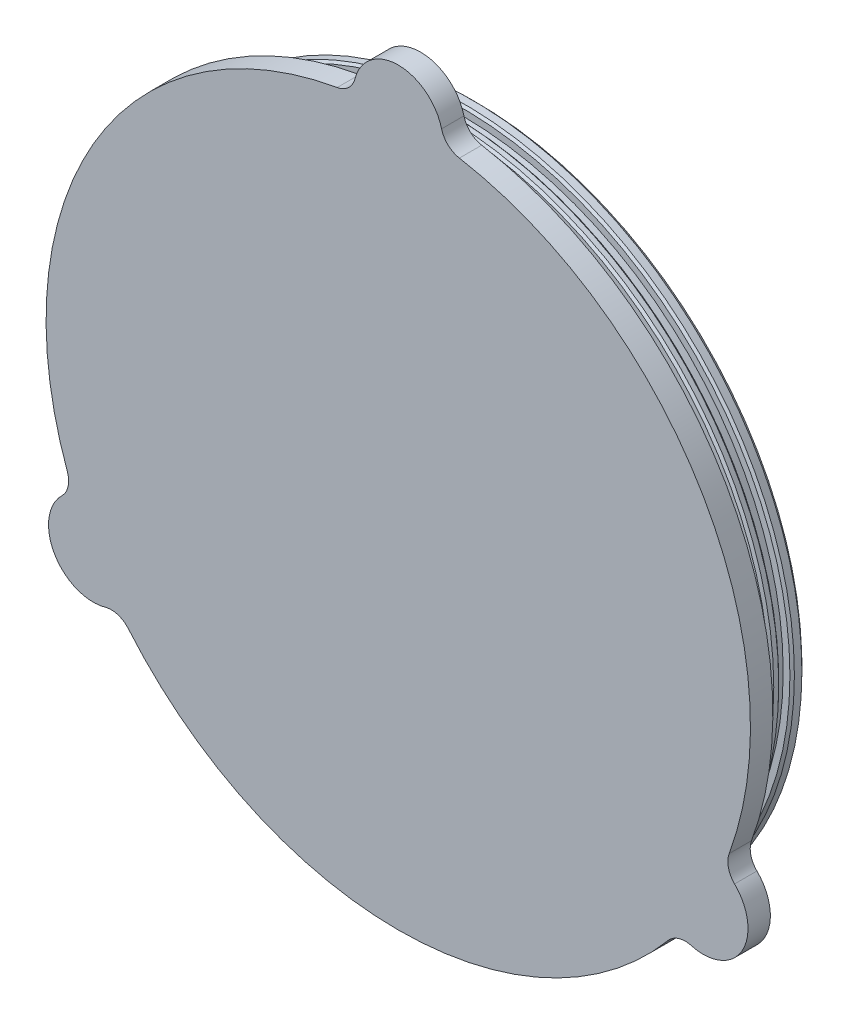
ISO-10303-21;
HEADER;
FILE_DESCRIPTION(('STEP AP214'),'2;1');
FILE_NAME('part.step','',(''),(''),'','','');
FILE_SCHEMA(('AUTOMOTIVE_DESIGN { 1 0 10303 214 1 1 1 1 }'));
ENDSEC;
DATA;
#1=APPLICATION_CONTEXT('core data for automotive mechanical design processes');
#2=APPLICATION_PROTOCOL_DEFINITION('international standard','automotive_design',2000,#1);
#3=PRODUCT_CONTEXT('',#1,'mechanical');
#4=PRODUCT('Part','Part','',(#3));
#5=PRODUCT_RELATED_PRODUCT_CATEGORY('part','',(#4));
#6=PRODUCT_DEFINITION_FORMATION('','',#4);
#7=PRODUCT_DEFINITION_CONTEXT('part definition',#1,'design');
#8=PRODUCT_DEFINITION('design','',#6,#7);
#9=PRODUCT_DEFINITION_SHAPE('','',#8);
#10=(LENGTH_UNIT() NAMED_UNIT(*) SI_UNIT(.MILLI.,.METRE.));
#11=(NAMED_UNIT(*) PLANE_ANGLE_UNIT() SI_UNIT($,.RADIAN.));
#12=(NAMED_UNIT(*) SI_UNIT($,.STERADIAN.) SOLID_ANGLE_UNIT());
#13=UNCERTAINTY_MEASURE_WITH_UNIT(LENGTH_MEASURE(1.E-05),#10,'distance_accuracy_value','');
#14=(GEOMETRIC_REPRESENTATION_CONTEXT(3) GLOBAL_UNCERTAINTY_ASSIGNED_CONTEXT((#13)) GLOBAL_UNIT_ASSIGNED_CONTEXT((#10,
#11,#12)) REPRESENTATION_CONTEXT('',''));
#15=CARTESIAN_POINT('',(0.,0.,0.));
#16=DIRECTION('',(0.,0.,1.));
#17=DIRECTION('',(1.,0.,0.));
#18=AXIS2_PLACEMENT_3D('',#15,#16,#17);
#19=CARTESIAN_POINT('',(0.,0.,6.35));
#20=DIRECTION('',(0.,0.,-1.));
#21=DIRECTION('',(-1.,0.,0.));
#22=AXIS2_PLACEMENT_3D('',#19,#20,#21);
#23=CYLINDRICAL_SURFACE('',#22,100.0125);
#24=CARTESIAN_POINT('',(0.,0.,6.35));
#25=DIRECTION('',(0.,0.,1.));
#26=DIRECTION('',(1.,0.,0.));
#27=AXIS2_PLACEMENT_3D('',#24,#25,#26);
#28=CIRCLE('',#27,100.0125);
#29=CARTESIAN_POINT('',(-17.3499847048401,98.4960820895522,6.35));
#30=VERTEX_POINT('',#29);
#31=CARTESIAN_POINT('',(-93.9751016152096,-34.2225135351136,6.35));
#32=VERTEX_POINT('',#31);
#33=EDGE_CURVE('E136',#30,#32,#28,.T.);
#34=ORIENTED_EDGE('',*,*,#33,.F.);
#35=DIRECTION('',(0.,0.,-1.));
#36=VECTOR('',#35,1.);
#37=CARTESIAN_POINT('',(-17.3499847048401,98.4960820895522,6.35));
#38=LINE('',#37,#36);
#39=CARTESIAN_POINT('',(-17.3499847048401,98.4960820895522,0.));
#40=VERTEX_POINT('',#39);
#41=EDGE_CURVE('E166',#30,#40,#38,.T.);
#42=ORIENTED_EDGE('',*,*,#41,.T.);
#43=CARTESIAN_POINT('',(0.,0.,0.));
#44=DIRECTION('',(0.,0.,1.));
#45=DIRECTION('',(1.,0.,0.));
#46=AXIS2_PLACEMENT_3D('',#43,#44,#45);
#47=CIRCLE('',#46,100.0125);
#48=CARTESIAN_POINT('',(-93.9751016152096,-34.2225135351136,0.));
#49=VERTEX_POINT('',#48);
#50=EDGE_CURVE('E196',#40,#49,#47,.T.);
#51=ORIENTED_EDGE('',*,*,#50,.T.);
#52=DIRECTION('',(0.,0.,-1.));
#53=VECTOR('',#52,1.);
#54=CARTESIAN_POINT('',(-93.9751016152096,-34.2225135351136,6.35));
#55=LINE('',#54,#53);
#56=EDGE_CURVE('E163',#49,#32,#55,.F.);
#57=ORIENTED_EDGE('',*,*,#56,.T.);
#58=EDGE_LOOP('',(#34,#42,#51,#57));
#59=FACE_BOUND('',#58,.T.);
#60=ADVANCED_FACE('F35',(#59),#23,.T.);
#61=CARTESIAN_POINT('',(-76.6251169103693,-64.2735685544395,0.));
#62=VERTEX_POINT('',#61);
#63=CARTESIAN_POINT('',(76.6251169103693,-64.2735685544394,0.));
#64=VERTEX_POINT('',#63);
#65=EDGE_CURVE('E206',#62,#64,#47,.T.);
#66=ORIENTED_EDGE('',*,*,#65,.T.);
#67=DIRECTION('',(0.,0.,-1.));
#68=VECTOR('',#67,1.);
#69=CARTESIAN_POINT('',(76.6251169103693,-64.2735685544394,6.35));
#70=LINE('',#69,#68);
#71=CARTESIAN_POINT('',(76.6251169103693,-64.2735685544394,6.35));
#72=VERTEX_POINT('',#71);
#73=EDGE_CURVE('E135',#64,#72,#70,.F.);
#74=ORIENTED_EDGE('',*,*,#73,.T.);
#75=CARTESIAN_POINT('',(-76.6251169103693,-64.2735685544395,6.35));
#76=VERTEX_POINT('',#75);
#77=EDGE_CURVE('E125',#76,#72,#28,.T.);
#78=ORIENTED_EDGE('',*,*,#77,.F.);
#79=DIRECTION('',(0.,0.,-1.));
#80=VECTOR('',#79,1.);
#81=CARTESIAN_POINT('',(-76.6251169103693,-64.2735685544395,6.35));
#82=LINE('',#81,#80);
#83=EDGE_CURVE('E132',#76,#62,#82,.T.);
#84=ORIENTED_EDGE('',*,*,#83,.T.);
#85=EDGE_LOOP('',(#66,#74,#78,#84));
#86=FACE_BOUND('',#85,.T.);
#87=ADVANCED_FACE('F131',(#86),#23,.T.);
#88=CARTESIAN_POINT('',(0.,0.,-15.875));
#89=DIRECTION('',(0.,0.,1.));
#90=DIRECTION('',(1.,0.,0.));
#91=AXIS2_PLACEMENT_3D('',#88,#89,#90);
#92=CYLINDRICAL_SURFACE('',#91,93.6625);
#93=CARTESIAN_POINT('',(0.,0.,-6.61841179374618));
#94=DIRECTION('',(0.,0.,1.));
#95=DIRECTION('',(1.,0.,0.));
#96=AXIS2_PLACEMENT_3D('',#93,#94,#95);
#97=CIRCLE('',#96,93.6625);
#98=CARTESIAN_POINT('',(93.6625,0.,-6.61841179374618));
#99=VERTEX_POINT('',#98);
#100=EDGE_CURVE('E265',#99,#99,#97,.F.);
#101=ORIENTED_EDGE('',*,*,#100,.T.);
#102=EDGE_LOOP('',(#101));
#103=FACE_BOUND('',#102,.T.);
#104=CARTESIAN_POINT('',(0.,0.,-8.0294907406934));
#105=DIRECTION('',(0.,0.,-1.));
#106=DIRECTION('',(-1.,0.,0.));
#107=AXIS2_PLACEMENT_3D('',#104,#105,#106);
#108=CIRCLE('',#107,93.6625);
#109=CARTESIAN_POINT('',(-93.6625,0.,-8.0294907406934));
#110=VERTEX_POINT('',#109);
#111=EDGE_CURVE('E262',#110,#110,#108,.F.);
#112=ORIENTED_EDGE('',*,*,#111,.T.);
#113=EDGE_LOOP('',(#112));
#114=FACE_BOUND('',#113,.T.);
#115=ADVANCED_FACE('F299',(#103,#114),#92,.T.);
#116=CARTESIAN_POINT('',(0.,0.,-2.17341179374612));
#117=DIRECTION('',(0.,0.,-1.));
#118=DIRECTION('',(-1.,0.,0.));
#119=AXIS2_PLACEMENT_3D('',#116,#117,#118);
#120=CIRCLE('',#119,93.6625);
#121=CARTESIAN_POINT('',(-93.6625,0.,-2.17341179374612));
#122=VERTEX_POINT('',#121);
#123=EDGE_CURVE('E253',#122,#122,#120,.F.);
#124=ORIENTED_EDGE('',*,*,#123,.T.);
#125=EDGE_LOOP('',(#124));
#126=FACE_BOUND('',#125,.T.);
#127=CARTESIAN_POINT('',(0.,0.,0.));
#128=DIRECTION('',(0.,0.,1.));
#129=DIRECTION('',(1.,0.,0.));
#130=AXIS2_PLACEMENT_3D('',#127,#128,#129);
#131=CIRCLE('',#130,93.6625);
#132=CARTESIAN_POINT('',(93.6625,0.,0.));
#133=VERTEX_POINT('',#132);
#134=EDGE_CURVE('E243',#133,#133,#131,.F.);
#135=ORIENTED_EDGE('',*,*,#134,.T.);
#136=EDGE_LOOP('',(#135));
#137=FACE_BOUND('',#136,.T.);
#138=ADVANCED_FACE('F310',(#126,#137),#92,.T.);
#139=CARTESIAN_POINT('',(0.,0.,0.));
#140=DIRECTION('',(0.,0.,1.));
#141=DIRECTION('',(1.,0.,0.));
#142=AXIS2_PLACEMENT_3D('',#139,#140,#141);
#143=PLANE('',#142);
#144=ORIENTED_EDGE('',*,*,#50,.F.);
#145=CARTESIAN_POINT('',(-18.4515710353062,104.749801587302,0.));
#146=DIRECTION('',(0.,0.,1.));
#147=DIRECTION('',(1.,0.,0.));
#148=AXIS2_PLACEMENT_3D('',#145,#146,#147);
#149=CIRCLE('',#148,6.35);
#150=CARTESIAN_POINT('',(-12.3010473568708,103.170701058201,0.));
#151=VERTEX_POINT('',#150);
#152=EDGE_CURVE('E186',#40,#151,#149,.T.);
#153=ORIENTED_EDGE('',*,*,#152,.T.);
#154=CARTESIAN_POINT('',(0.,100.0125,0.));
#155=DIRECTION('',(0.,0.,1.));
#156=DIRECTION('',(1.,0.,0.));
#157=AXIS2_PLACEMENT_3D('',#154,#155,#156);
#158=CIRCLE('',#157,12.7);
#159=CARTESIAN_POINT('',(12.3010473568708,103.170701058201,0.));
#160=VERTEX_POINT('',#159);
#161=EDGE_CURVE('E223',#151,#160,#158,.F.);
#162=ORIENTED_EDGE('',*,*,#161,.T.);
#163=CARTESIAN_POINT('',(18.4515710353061,104.749801587302,0.));
#164=DIRECTION('',(0.,0.,1.));
#165=DIRECTION('',(1.,0.,0.));
#166=AXIS2_PLACEMENT_3D('',#163,#164,#165);
#167=CIRCLE('',#166,6.35);
#168=CARTESIAN_POINT('',(17.3499847048401,98.4960820895522,0.));
#169=VERTEX_POINT('',#168);
#170=EDGE_CURVE('E182',#160,#169,#167,.T.);
#171=ORIENTED_EDGE('',*,*,#170,.T.);
#172=CARTESIAN_POINT('',(93.9751016152096,-34.2225135351135,0.));
#173=VERTEX_POINT('',#172);
#174=EDGE_CURVE('E208',#173,#169,#47,.T.);
#175=ORIENTED_EDGE('',*,*,#174,.F.);
#176=CARTESIAN_POINT('',(99.9417747336356,-36.3953715373429,0.));
#177=DIRECTION('',(0.,0.,1.));
#178=DIRECTION('',(1.,0.,0.));
#179=AXIS2_PLACEMENT_3D('',#176,#177,#178);
#180=CIRCLE('',#179,6.35);
#181=CARTESIAN_POINT('',(95.4989717210874,-40.9323310248954,0.));
#182=VERTEX_POINT('',#181);
#183=EDGE_CURVE('E178',#173,#182,#180,.T.);
#184=ORIENTED_EDGE('',*,*,#183,.T.);
#185=CARTESIAN_POINT('',(86.6133656959909,-50.0062500000004,0.));
#186=DIRECTION('',(0.,0.,1.));
#187=DIRECTION('',(1.,0.,0.));
#188=AXIS2_PLACEMENT_3D('',#185,#186,#187);
#189=CIRCLE('',#188,12.7);
#190=CARTESIAN_POINT('',(83.1979243642165,-62.2383700333064,0.));
#191=VERTEX_POINT('',#190);
#192=EDGE_CURVE('E218',#182,#191,#189,.F.);
#193=ORIENTED_EDGE('',*,*,#192,.T.);
#194=CARTESIAN_POINT('',(81.4902036983293,-68.3544300499594,0.));
#195=DIRECTION('',(0.,0.,1.));
#196=DIRECTION('',(1.,0.,0.));
#197=AXIS2_PLACEMENT_3D('',#194,#195,#196);
#198=CIRCLE('',#197,6.35);
#199=EDGE_CURVE('E174',#191,#64,#198,.T.);
#200=ORIENTED_EDGE('',*,*,#199,.T.);
#201=ORIENTED_EDGE('',*,*,#65,.F.);
#202=CARTESIAN_POINT('',(-81.4902036983292,-68.3544300499595,0.));
#203=DIRECTION('',(0.,0.,1.));
#204=DIRECTION('',(1.,0.,0.));
#205=AXIS2_PLACEMENT_3D('',#202,#203,#204);
#206=CIRCLE('',#205,6.35);
#207=CARTESIAN_POINT('',(-83.1979243642165,-62.2383700333065,0.));
#208=VERTEX_POINT('',#207);
#209=EDGE_CURVE('E11',#62,#208,#206,.T.);
#210=ORIENTED_EDGE('',*,*,#209,.T.);
#211=CARTESIAN_POINT('',(-86.6133656959909,-50.0062500000004,0.));
#212=DIRECTION('',(0.,0.,1.));
#213=DIRECTION('',(1.,0.,0.));
#214=AXIS2_PLACEMENT_3D('',#211,#212,#213);
#215=CIRCLE('',#214,12.7);
#216=CARTESIAN_POINT('',(-95.4989717210874,-40.9323310248955,0.));
#217=VERTEX_POINT('',#216);
#218=EDGE_CURVE('E199',#208,#217,#215,.F.);
#219=ORIENTED_EDGE('',*,*,#218,.T.);
#220=CARTESIAN_POINT('',(-99.9417747336356,-36.395371537343,0.));
#221=DIRECTION('',(0.,0.,1.));
#222=DIRECTION('',(1.,0.,0.));
#223=AXIS2_PLACEMENT_3D('',#220,#221,#222);
#224=CIRCLE('',#223,6.35);
#225=EDGE_CURVE('E127',#217,#49,#224,.T.);
#226=ORIENTED_EDGE('',*,*,#225,.T.);
#227=EDGE_LOOP('',(#144,#153,#162,#171,#175,#184,#193,#200,#201,#210,#219,#226));
#228=FACE_BOUND('',#227,.T.);
#229=ORIENTED_EDGE('',*,*,#134,.F.);
#230=EDGE_LOOP('',(#229));
#231=FACE_BOUND('',#230,.T.);
#232=ADVANCED_FACE('F194',(#228,#231),#143,.F.);
#233=CARTESIAN_POINT('',(93.9751016152096,-34.2225135351135,6.35));
#234=VERTEX_POINT('',#233);
#235=CARTESIAN_POINT('',(17.3499847048401,98.4960820895522,6.35));
#236=VERTEX_POINT('',#235);
#237=EDGE_CURVE('E137',#234,#236,#28,.T.);
#238=ORIENTED_EDGE('',*,*,#237,.F.);
#239=DIRECTION('',(0.,0.,-1.));
#240=VECTOR('',#239,1.);
#241=CARTESIAN_POINT('',(93.9751016152096,-34.2225135351135,6.35));
#242=LINE('',#241,#240);
#243=EDGE_CURVE('E156',#234,#173,#242,.T.);
#244=ORIENTED_EDGE('',*,*,#243,.T.);
#245=ORIENTED_EDGE('',*,*,#174,.T.);
#246=DIRECTION('',(0.,0.,-1.));
#247=VECTOR('',#246,1.);
#248=CARTESIAN_POINT('',(17.3499847048401,98.4960820895522,6.35));
#249=LINE('',#248,#247);
#250=EDGE_CURVE('E153',#169,#236,#249,.F.);
#251=ORIENTED_EDGE('',*,*,#250,.T.);
#252=EDGE_LOOP('',(#238,#244,#245,#251));
#253=FACE_BOUND('',#252,.T.);
#254=ADVANCED_FACE('F295',(#253),#23,.T.);
#255=CARTESIAN_POINT('',(0.,0.,6.35));
#256=DIRECTION('',(0.,0.,1.));
#257=DIRECTION('',(1.,0.,0.));
#258=AXIS2_PLACEMENT_3D('',#255,#256,#257);
#259=PLANE('',#258);
#260=CARTESIAN_POINT('',(0.,100.0125,6.35));
#261=DIRECTION('',(0.,0.,1.));
#262=DIRECTION('',(-1.,0.,0.));
#263=AXIS2_PLACEMENT_3D('',#260,#261,#262);
#264=CIRCLE('',#263,12.7);
#265=CARTESIAN_POINT('',(12.3010473568708,103.170701058201,6.35));
#266=VERTEX_POINT('',#265);
#267=CARTESIAN_POINT('',(-12.3010473568708,103.170701058201,6.35));
#268=VERTEX_POINT('',#267);
#269=EDGE_CURVE('E221',#266,#268,#264,.T.);
#270=ORIENTED_EDGE('',*,*,#269,.T.);
#271=CARTESIAN_POINT('',(-18.4515710353062,104.749801587302,6.35));
#272=DIRECTION('',(0.,0.,1.));
#273=DIRECTION('',(1.,0.,0.));
#274=AXIS2_PLACEMENT_3D('',#271,#272,#273);
#275=CIRCLE('',#274,6.35);
#276=EDGE_CURVE('E184',#268,#30,#275,.F.);
#277=ORIENTED_EDGE('',*,*,#276,.T.);
#278=ORIENTED_EDGE('',*,*,#33,.T.);
#279=CARTESIAN_POINT('',(-99.9417747336356,-36.395371537343,6.35));
#280=DIRECTION('',(0.,0.,1.));
#281=DIRECTION('',(1.,0.,0.));
#282=AXIS2_PLACEMENT_3D('',#279,#280,#281);
#283=CIRCLE('',#282,6.35);
#284=CARTESIAN_POINT('',(-95.4989717210874,-40.9323310248955,6.35));
#285=VERTEX_POINT('',#284);
#286=EDGE_CURVE('E57',#32,#285,#283,.F.);
#287=ORIENTED_EDGE('',*,*,#286,.T.);
#288=CARTESIAN_POINT('',(-86.6133656959909,-50.0062500000004,6.35));
#289=DIRECTION('',(0.,0.,1.));
#290=DIRECTION('',(1.,0.,0.));
#291=AXIS2_PLACEMENT_3D('',#288,#289,#290);
#292=CIRCLE('',#291,12.7);
#293=CARTESIAN_POINT('',(-83.1979243642165,-62.2383700333065,6.35));
#294=VERTEX_POINT('',#293);
#295=EDGE_CURVE('E126',#285,#294,#292,.T.);
#296=ORIENTED_EDGE('',*,*,#295,.T.);
#297=CARTESIAN_POINT('',(-81.4902036983292,-68.3544300499595,6.35));
#298=DIRECTION('',(0.,0.,1.));
#299=DIRECTION('',(1.,0.,0.));
#300=AXIS2_PLACEMENT_3D('',#297,#298,#299);
#301=CIRCLE('',#300,6.35);
#302=EDGE_CURVE('E43',#294,#76,#301,.F.);
#303=ORIENTED_EDGE('',*,*,#302,.T.);
#304=ORIENTED_EDGE('',*,*,#77,.T.);
#305=CARTESIAN_POINT('',(81.4902036983293,-68.3544300499594,6.35));
#306=DIRECTION('',(0.,0.,1.));
#307=DIRECTION('',(1.,0.,0.));
#308=AXIS2_PLACEMENT_3D('',#305,#306,#307);
#309=CIRCLE('',#308,6.35);
#310=CARTESIAN_POINT('',(83.1979243642165,-62.2383700333064,6.35));
#311=VERTEX_POINT('',#310);
#312=EDGE_CURVE('E172',#72,#311,#309,.F.);
#313=ORIENTED_EDGE('',*,*,#312,.T.);
#314=CARTESIAN_POINT('',(86.6133656959909,-50.0062500000004,6.35));
#315=DIRECTION('',(0.,0.,1.));
#316=DIRECTION('',(-1.,0.,0.));
#317=AXIS2_PLACEMENT_3D('',#314,#315,#316);
#318=CIRCLE('',#317,12.7);
#319=CARTESIAN_POINT('',(95.4989717210874,-40.9323310248954,6.35));
#320=VERTEX_POINT('',#319);
#321=EDGE_CURVE('E213',#311,#320,#318,.T.);
#322=ORIENTED_EDGE('',*,*,#321,.T.);
#323=CARTESIAN_POINT('',(99.9417747336356,-36.3953715373429,6.35));
#324=DIRECTION('',(0.,0.,1.));
#325=DIRECTION('',(1.,0.,0.));
#326=AXIS2_PLACEMENT_3D('',#323,#324,#325);
#327=CIRCLE('',#326,6.35);
#328=EDGE_CURVE('E176',#320,#234,#327,.F.);
#329=ORIENTED_EDGE('',*,*,#328,.T.);
#330=ORIENTED_EDGE('',*,*,#237,.T.);
#331=CARTESIAN_POINT('',(18.4515710353061,104.749801587302,6.35));
#332=DIRECTION('',(0.,0.,1.));
#333=DIRECTION('',(1.,0.,0.));
#334=AXIS2_PLACEMENT_3D('',#331,#332,#333);
#335=CIRCLE('',#334,6.35);
#336=EDGE_CURVE('E180',#236,#266,#335,.F.);
#337=ORIENTED_EDGE('',*,*,#336,.T.);
#338=EDGE_LOOP('',(#270,#277,#278,#287,#296,#303,#304,#313,#322,#329,#330,#337));
#339=FACE_BOUND('',#338,.T.);
#340=ADVANCED_FACE('F124',(#339),#259,.T.);
#341=CARTESIAN_POINT('',(0.,93.6625,-2.80841179374613));
#342=DIRECTION('',(0.,0.,-1.));
#343=DIRECTION('',(-1.,0.,0.));
#344=AXIS2_PLACEMENT_3D('',#341,#342,#343);
#345=PLANE('',#344);
#346=CARTESIAN_POINT('',(0.,0.,-2.80841179374613));
#347=DIRECTION('',(0.,0.,-1.));
#348=DIRECTION('',(-1.,0.,0.));
#349=AXIS2_PLACEMENT_3D('',#346,#347,#348);
#350=CIRCLE('',#349,93.0275);
#351=CARTESIAN_POINT('',(-93.0275,0.,-2.80841179374613));
#352=VERTEX_POINT('',#351);
#353=EDGE_CURVE('E256',#352,#352,#350,.T.);
#354=ORIENTED_EDGE('',*,*,#353,.T.);
#355=EDGE_LOOP('',(#354));
#356=FACE_BOUND('',#355,.T.);
#357=CARTESIAN_POINT('',(0.,0.,-2.80841179374613));
#358=DIRECTION('',(0.,0.,1.));
#359=DIRECTION('',(1.,0.,0.));
#360=AXIS2_PLACEMENT_3D('',#357,#358,#359);
#361=CIRCLE('',#360,91.1225);
#362=CARTESIAN_POINT('',(91.1225,0.,-2.80841179374613));
#363=VERTEX_POINT('',#362);
#364=EDGE_CURVE('E235',#363,#363,#361,.T.);
#365=ORIENTED_EDGE('',*,*,#364,.T.);
#366=EDGE_LOOP('',(#365));
#367=FACE_BOUND('',#366,.T.);
#368=ADVANCED_FACE('F308',(#356,#367),#345,.T.);
#369=CARTESIAN_POINT('',(0.,0.,0.));
#370=DIRECTION('',(0.,0.,1.));
#371=DIRECTION('',(1.,0.,0.));
#372=AXIS2_PLACEMENT_3D('',#369,#370,#371);
#373=CYLINDRICAL_SURFACE('',#372,91.1225);
#374=CARTESIAN_POINT('',(0.,0.,-5.98341179374613));
#375=DIRECTION('',(0.,0.,1.));
#376=DIRECTION('',(1.,0.,0.));
#377=AXIS2_PLACEMENT_3D('',#374,#375,#376);
#378=CIRCLE('',#377,91.1225);
#379=CARTESIAN_POINT('',(91.1225,0.,-5.98341179374613));
#380=VERTEX_POINT('',#379);
#381=EDGE_CURVE('E232',#380,#380,#378,.T.);
#382=ORIENTED_EDGE('',*,*,#381,.T.);
#383=EDGE_LOOP('',(#382));
#384=FACE_BOUND('',#383,.T.);
#385=ORIENTED_EDGE('',*,*,#364,.F.);
#386=EDGE_LOOP('',(#385));
#387=FACE_BOUND('',#386,.T.);
#388=ADVANCED_FACE('F501',(#384,#387),#373,.T.);
#389=CARTESIAN_POINT('',(0.,93.6625,-5.98341179374613));
#390=DIRECTION('',(0.,0.,1.));
#391=DIRECTION('',(1.,0.,0.));
#392=AXIS2_PLACEMENT_3D('',#389,#390,#391);
#393=PLANE('',#392);
#394=CARTESIAN_POINT('',(0.,0.,-5.98341179374613));
#395=DIRECTION('',(0.,0.,1.));
#396=DIRECTION('',(1.,0.,0.));
#397=AXIS2_PLACEMENT_3D('',#394,#395,#396);
#398=CIRCLE('',#397,93.0274999999999);
#399=CARTESIAN_POINT('',(93.0274999999999,0.,-5.98341179374613));
#400=VERTEX_POINT('',#399);
#401=EDGE_CURVE('E259',#400,#400,#398,.T.);
#402=ORIENTED_EDGE('',*,*,#401,.T.);
#403=EDGE_LOOP('',(#402));
#404=FACE_BOUND('',#403,.T.);
#405=ORIENTED_EDGE('',*,*,#381,.F.);
#406=EDGE_LOOP('',(#405));
#407=FACE_BOUND('',#406,.T.);
#408=ADVANCED_FACE('F492',(#404,#407),#393,.T.);
#409=CARTESIAN_POINT('',(0.,93.6625,-8.66449074069338));
#410=DIRECTION('',(0.,0.,-1.));
#411=DIRECTION('',(-1.,0.,0.));
#412=AXIS2_PLACEMENT_3D('',#409,#410,#411);
#413=PLANE('',#412);
#414=CARTESIAN_POINT('',(0.,0.,-8.66449074069338));
#415=DIRECTION('',(0.,0.,-1.));
#416=DIRECTION('',(-1.,0.,0.));
#417=AXIS2_PLACEMENT_3D('',#414,#415,#416);
#418=CIRCLE('',#417,93.0275);
#419=CARTESIAN_POINT('',(-93.0275,0.,-8.66449074069338));
#420=VERTEX_POINT('',#419);
#421=EDGE_CURVE('E268',#420,#420,#418,.T.);
#422=ORIENTED_EDGE('',*,*,#421,.T.);
#423=EDGE_LOOP('',(#422));
#424=FACE_BOUND('',#423,.T.);
#425=CARTESIAN_POINT('',(0.,0.,-8.66449074069338));
#426=DIRECTION('',(0.,0.,1.));
#427=DIRECTION('',(1.,0.,0.));
#428=AXIS2_PLACEMENT_3D('',#425,#426,#427);
#429=CIRCLE('',#428,91.1225);
#430=CARTESIAN_POINT('',(91.1225,0.,-8.66449074069338));
#431=VERTEX_POINT('',#430);
#432=EDGE_CURVE('E229',#431,#431,#429,.T.);
#433=ORIENTED_EDGE('',*,*,#432,.T.);
#434=EDGE_LOOP('',(#433));
#435=FACE_BOUND('',#434,.T.);
#436=ADVANCED_FACE('F483',(#424,#435),#413,.T.);
#437=CARTESIAN_POINT('',(0.,0.,0.));
#438=DIRECTION('',(0.,0.,1.));
#439=DIRECTION('',(1.,0.,0.));
#440=AXIS2_PLACEMENT_3D('',#437,#438,#439);
#441=CYLINDRICAL_SURFACE('',#440,91.1225);
#442=CARTESIAN_POINT('',(0.,0.,-11.8394907406934));
#443=DIRECTION('',(0.,0.,1.));
#444=DIRECTION('',(1.,0.,0.));
#445=AXIS2_PLACEMENT_3D('',#442,#443,#444);
#446=CIRCLE('',#445,91.1225);
#447=CARTESIAN_POINT('',(91.1225,0.,-11.8394907406934));
#448=VERTEX_POINT('',#447);
#449=EDGE_CURVE('E226',#448,#448,#446,.T.);
#450=ORIENTED_EDGE('',*,*,#449,.T.);
#451=EDGE_LOOP('',(#450));
#452=FACE_BOUND('',#451,.T.);
#453=ORIENTED_EDGE('',*,*,#432,.F.);
#454=EDGE_LOOP('',(#453));
#455=FACE_BOUND('',#454,.T.);
#456=ADVANCED_FACE('F474',(#452,#455),#441,.T.);
#457=CARTESIAN_POINT('',(0.,93.6625,-11.8394907406934));
#458=DIRECTION('',(0.,0.,1.));
#459=DIRECTION('',(1.,0.,0.));
#460=AXIS2_PLACEMENT_3D('',#457,#458,#459);
#461=PLANE('',#460);
#462=CARTESIAN_POINT('',(0.,0.,-11.8394907406934));
#463=DIRECTION('',(0.,0.,1.));
#464=DIRECTION('',(1.,0.,0.));
#465=AXIS2_PLACEMENT_3D('',#462,#463,#464);
#466=CIRCLE('',#465,93.0275000000001);
#467=CARTESIAN_POINT('',(93.0275000000001,0.,-11.8394907406934));
#468=VERTEX_POINT('',#467);
#469=EDGE_CURVE('E145',#468,#468,#466,.T.);
#470=ORIENTED_EDGE('',*,*,#469,.T.);
#471=EDGE_LOOP('',(#470));
#472=FACE_BOUND('',#471,.T.);
#473=ORIENTED_EDGE('',*,*,#449,.F.);
#474=EDGE_LOOP('',(#473));
#475=FACE_BOUND('',#474,.T.);
#476=ADVANCED_FACE('F273',(#472,#475),#461,.T.);
#477=CARTESIAN_POINT('',(0.,0.,0.));
#478=DIRECTION('',(0.,0.,-1.));
#479=DIRECTION('',(-1.,0.,0.));
#480=AXIS2_PLACEMENT_3D('',#477,#478,#479);
#481=PLANE('',#480);
#482=CARTESIAN_POINT('',(0.,0.,0.));
#483=DIRECTION('',(0.,0.,-1.));
#484=DIRECTION('',(-1.,0.,0.));
#485=AXIS2_PLACEMENT_3D('',#482,#483,#484);
#486=CIRCLE('',#485,87.3125);
#487=CARTESIAN_POINT('',(-87.3125,0.,0.));
#488=VERTEX_POINT('',#487);
#489=EDGE_CURVE('E239',#488,#488,#486,.T.);
#490=ORIENTED_EDGE('',*,*,#489,.T.);
#491=EDGE_LOOP('',(#490));
#492=FACE_BOUND('',#491,.T.);
#493=ADVANCED_FACE('F473',(#492),#481,.T.);
#494=CARTESIAN_POINT('',(0.,0.,0.));
#495=DIRECTION('',(0.,0.,-1.));
#496=DIRECTION('',(-1.,0.,0.));
#497=AXIS2_PLACEMENT_3D('',#494,#495,#496);
#498=CYLINDRICAL_SURFACE('',#497,87.3125);
#499=ORIENTED_EDGE('',*,*,#489,.F.);
#500=EDGE_LOOP('',(#499));
#501=FACE_BOUND('',#500,.T.);
#502=CARTESIAN_POINT('',(0.,0.,-15.875));
#503=DIRECTION('',(0.,0.,-1.));
#504=DIRECTION('',(-1.,0.,0.));
#505=AXIS2_PLACEMENT_3D('',#502,#503,#504);
#506=CIRCLE('',#505,87.3125);
#507=CARTESIAN_POINT('',(-87.3125,0.,-15.875));
#508=VERTEX_POINT('',#507);
#509=EDGE_CURVE('E238',#508,#508,#506,.T.);
#510=ORIENTED_EDGE('',*,*,#509,.T.);
#511=EDGE_LOOP('',(#510));
#512=FACE_BOUND('',#511,.T.);
#513=ADVANCED_FACE('F546',(#501,#512),#498,.F.);
#514=CARTESIAN_POINT('',(0.,0.,-15.875));
#515=DIRECTION('',(0.,0.,-1.));
#516=DIRECTION('',(-1.,0.,0.));
#517=AXIS2_PLACEMENT_3D('',#514,#515,#516);
#518=PLANE('',#517);
#519=CARTESIAN_POINT('',(0.,0.,-15.875));
#520=DIRECTION('',(0.,0.,-1.));
#521=DIRECTION('',(-1.,0.,0.));
#522=AXIS2_PLACEMENT_3D('',#519,#520,#521);
#523=CIRCLE('',#522,92.3925);
#524=CARTESIAN_POINT('',(-92.3925,0.,-15.875));
#525=VERTEX_POINT('',#524);
#526=EDGE_CURVE('E247',#525,#525,#523,.T.);
#527=ORIENTED_EDGE('',*,*,#526,.T.);
#528=EDGE_LOOP('',(#527));
#529=FACE_BOUND('',#528,.T.);
#530=ORIENTED_EDGE('',*,*,#509,.F.);
#531=EDGE_LOOP('',(#530));
#532=FACE_BOUND('',#531,.T.);
#533=ADVANCED_FACE('F533',(#529,#532),#518,.T.);
#534=CARTESIAN_POINT('',(0.,0.,-12.4744907406933));
#535=DIRECTION('',(0.,0.,1.));
#536=DIRECTION('',(1.,0.,0.));
#537=AXIS2_PLACEMENT_3D('',#534,#535,#536);
#538=CIRCLE('',#537,93.6625);
#539=CARTESIAN_POINT('',(93.6625,0.,-12.4744907406933));
#540=VERTEX_POINT('',#539);
#541=EDGE_CURVE('E140',#540,#540,#538,.F.);
#542=ORIENTED_EDGE('',*,*,#541,.T.);
#543=EDGE_LOOP('',(#542));
#544=FACE_BOUND('',#543,.T.);
#545=CARTESIAN_POINT('',(0.,0.,-14.605));
#546=DIRECTION('',(0.,0.,-1.));
#547=DIRECTION('',(-1.,0.,0.));
#548=AXIS2_PLACEMENT_3D('',#545,#546,#547);
#549=CIRCLE('',#548,93.6625);
#550=CARTESIAN_POINT('',(-93.6625,0.,-14.605));
#551=VERTEX_POINT('',#550);
#552=EDGE_CURVE('E250',#551,#551,#549,.F.);
#553=ORIENTED_EDGE('',*,*,#552,.T.);
#554=EDGE_LOOP('',(#553));
#555=FACE_BOUND('',#554,.T.);
#556=ADVANCED_FACE('F463',(#544,#555),#92,.T.);
#557=CARTESIAN_POINT('',(0.,0.,-15.875));
#558=DIRECTION('',(0.,0.,1.));
#559=DIRECTION('',(1.,0.,0.));
#560=AXIS2_PLACEMENT_3D('',#557,#558,#559);
#561=CONICAL_SURFACE('',#560,92.3925,0.785398163397448);
#562=ORIENTED_EDGE('',*,*,#552,.F.);
#563=EDGE_LOOP('',(#562));
#564=FACE_BOUND('',#563,.T.);
#565=ORIENTED_EDGE('',*,*,#526,.F.);
#566=EDGE_LOOP('',(#565));
#567=FACE_BOUND('',#566,.T.);
#568=ADVANCED_FACE('F428',(#564,#567),#561,.T.);
#569=CARTESIAN_POINT('',(0.,100.0125,-31.1337893054916));
#570=DIRECTION('',(0.,0.,1.));
#571=DIRECTION('',(1.,0.,0.));
#572=AXIS2_PLACEMENT_3D('',#569,#570,#571);
#573=CYLINDRICAL_SURFACE('',#572,12.7);
#574=ORIENTED_EDGE('',*,*,#269,.F.);
#575=DIRECTION('',(0.,0.,1.));
#576=VECTOR('',#575,1.);
#577=CARTESIAN_POINT('',(12.3010473568708,103.170701058201,-31.1337893054916));
#578=LINE('',#577,#576);
#579=EDGE_CURVE('E161',#266,#160,#578,.F.);
#580=ORIENTED_EDGE('',*,*,#579,.T.);
#581=ORIENTED_EDGE('',*,*,#161,.F.);
#582=DIRECTION('',(0.,0.,1.));
#583=VECTOR('',#582,1.);
#584=CARTESIAN_POINT('',(-12.3010473568708,103.170701058201,-31.1337893054916));
#585=LINE('',#584,#583);
#586=EDGE_CURVE('E158',#151,#268,#585,.T.);
#587=ORIENTED_EDGE('',*,*,#586,.T.);
#588=EDGE_LOOP('',(#574,#580,#581,#587));
#589=FACE_BOUND('',#588,.T.);
#590=ADVANCED_FACE('F332',(#589),#573,.T.);
#591=CARTESIAN_POINT('',(86.6133656959909,-50.0062500000004,-31.1337893054916));
#592=DIRECTION('',(0.,0.,1.));
#593=DIRECTION('',(1.,0.,0.));
#594=AXIS2_PLACEMENT_3D('',#591,#592,#593);
#595=CYLINDRICAL_SURFACE('',#594,12.7);
#596=ORIENTED_EDGE('',*,*,#321,.F.);
#597=DIRECTION('',(0.,0.,1.));
#598=VECTOR('',#597,1.);
#599=CARTESIAN_POINT('',(83.1979243642165,-62.2383700333064,-31.1337893054916));
#600=LINE('',#599,#598);
#601=EDGE_CURVE('E151',#311,#191,#600,.F.);
#602=ORIENTED_EDGE('',*,*,#601,.T.);
#603=ORIENTED_EDGE('',*,*,#192,.F.);
#604=DIRECTION('',(0.,0.,1.));
#605=VECTOR('',#604,1.);
#606=CARTESIAN_POINT('',(95.4989717210874,-40.9323310248954,-31.1337893054916));
#607=LINE('',#606,#605);
#608=EDGE_CURVE('E142',#182,#320,#607,.T.);
#609=ORIENTED_EDGE('',*,*,#608,.T.);
#610=EDGE_LOOP('',(#596,#602,#603,#609));
#611=FACE_BOUND('',#610,.T.);
#612=ADVANCED_FACE('F324',(#611),#595,.T.);
#613=CARTESIAN_POINT('',(-86.6133656959909,-50.0062500000004,-31.1337893054916));
#614=DIRECTION('',(0.,0.,1.));
#615=DIRECTION('',(1.,0.,0.));
#616=AXIS2_PLACEMENT_3D('',#613,#614,#615);
#617=CYLINDRICAL_SURFACE('',#616,12.7);
#618=ORIENTED_EDGE('',*,*,#295,.F.);
#619=DIRECTION('',(0.,0.,1.));
#620=VECTOR('',#619,1.);
#621=CARTESIAN_POINT('',(-95.4989717210874,-40.9323310248955,-31.1337893054916));
#622=LINE('',#621,#620);
#623=EDGE_CURVE('E170',#285,#217,#622,.F.);
#624=ORIENTED_EDGE('',*,*,#623,.T.);
#625=ORIENTED_EDGE('',*,*,#218,.F.);
#626=DIRECTION('',(0.,0.,1.));
#627=VECTOR('',#626,1.);
#628=CARTESIAN_POINT('',(-83.1979243642165,-62.2383700333065,-31.1337893054916));
#629=LINE('',#628,#627);
#630=EDGE_CURVE('E168',#208,#294,#629,.T.);
#631=ORIENTED_EDGE('',*,*,#630,.T.);
#632=EDGE_LOOP('',(#618,#624,#625,#631));
#633=FACE_BOUND('',#632,.T.);
#634=ADVANCED_FACE('F211',(#633),#617,.T.);
#635=CARTESIAN_POINT('',(0.,0.,-2.17341179374612));
#636=DIRECTION('',(0.,0.,1.));
#637=DIRECTION('',(1.,0.,0.));
#638=AXIS2_PLACEMENT_3D('',#635,#636,#637);
#639=CONICAL_SURFACE('',#638,93.6625,0.785398163397459);
#640=ORIENTED_EDGE('',*,*,#353,.F.);
#641=EDGE_LOOP('',(#640));
#642=FACE_BOUND('',#641,.T.);
#643=ORIENTED_EDGE('',*,*,#123,.F.);
#644=EDGE_LOOP('',(#643));
#645=FACE_BOUND('',#644,.T.);
#646=ADVANCED_FACE('F397',(#642,#645),#639,.T.);
#647=CARTESIAN_POINT('',(0.,0.,-5.98341179374613));
#648=DIRECTION('',(0.,0.,-1.));
#649=DIRECTION('',(-1.,0.,0.));
#650=AXIS2_PLACEMENT_3D('',#647,#648,#649);
#651=CONICAL_SURFACE('',#650,93.0274999999999,0.785398163397448);
#652=ORIENTED_EDGE('',*,*,#100,.F.);
#653=EDGE_LOOP('',(#652));
#654=FACE_BOUND('',#653,.T.);
#655=ORIENTED_EDGE('',*,*,#401,.F.);
#656=EDGE_LOOP('',(#655));
#657=FACE_BOUND('',#656,.T.);
#658=ADVANCED_FACE('F289',(#654,#657),#651,.T.);
#659=CARTESIAN_POINT('',(0.,0.,-8.0294907406934));
#660=DIRECTION('',(0.,0.,1.));
#661=DIRECTION('',(1.,0.,0.));
#662=AXIS2_PLACEMENT_3D('',#659,#660,#661);
#663=CONICAL_SURFACE('',#662,93.6625,0.785398163397448);
#664=ORIENTED_EDGE('',*,*,#421,.F.);
#665=EDGE_LOOP('',(#664));
#666=FACE_BOUND('',#665,.T.);
#667=ORIENTED_EDGE('',*,*,#111,.F.);
#668=EDGE_LOOP('',(#667));
#669=FACE_BOUND('',#668,.T.);
#670=ADVANCED_FACE('F279',(#666,#669),#663,.T.);
#671=CARTESIAN_POINT('',(0.,0.,-11.8394907406934));
#672=DIRECTION('',(0.,0.,-1.));
#673=DIRECTION('',(-1.,0.,0.));
#674=AXIS2_PLACEMENT_3D('',#671,#672,#673);
#675=CONICAL_SURFACE('',#674,93.0275000000001,0.785398163397448);
#676=ORIENTED_EDGE('',*,*,#541,.F.);
#677=EDGE_LOOP('',(#676));
#678=FACE_BOUND('',#677,.T.);
#679=ORIENTED_EDGE('',*,*,#469,.F.);
#680=EDGE_LOOP('',(#679));
#681=FACE_BOUND('',#680,.T.);
#682=ADVANCED_FACE('F276',(#678,#681),#675,.T.);
#683=CARTESIAN_POINT('',(81.4902036983293,-68.3544300499594,-31.1337893054916));
#684=DIRECTION('',(0.,0.,-1.));
#685=DIRECTION('',(-1.,0.,0.));
#686=AXIS2_PLACEMENT_3D('',#683,#684,#685);
#687=CYLINDRICAL_SURFACE('',#686,6.35);
#688=ORIENTED_EDGE('',*,*,#199,.F.);
#689=ORIENTED_EDGE('',*,*,#601,.F.);
#690=ORIENTED_EDGE('',*,*,#312,.F.);
#691=ORIENTED_EDGE('',*,*,#73,.F.);
#692=EDGE_LOOP('',(#688,#689,#690,#691));
#693=FACE_BOUND('',#692,.T.);
#694=ADVANCED_FACE('F278',(#693),#687,.F.);
#695=CARTESIAN_POINT('',(99.9417747336356,-36.3953715373429,6.35));
#696=DIRECTION('',(0.,0.,-1.));
#697=DIRECTION('',(-1.,0.,0.));
#698=AXIS2_PLACEMENT_3D('',#695,#696,#697);
#699=CYLINDRICAL_SURFACE('',#698,6.35);
#700=ORIENTED_EDGE('',*,*,#183,.F.);
#701=ORIENTED_EDGE('',*,*,#243,.F.);
#702=ORIENTED_EDGE('',*,*,#328,.F.);
#703=ORIENTED_EDGE('',*,*,#608,.F.);
#704=EDGE_LOOP('',(#700,#701,#702,#703));
#705=FACE_BOUND('',#704,.T.);
#706=ADVANCED_FACE('F286',(#705),#699,.F.);
#707=CARTESIAN_POINT('',(18.4515710353061,104.749801587302,-31.1337893054916));
#708=DIRECTION('',(0.,0.,-1.));
#709=DIRECTION('',(-1.,0.,0.));
#710=AXIS2_PLACEMENT_3D('',#707,#708,#709);
#711=CYLINDRICAL_SURFACE('',#710,6.35);
#712=ORIENTED_EDGE('',*,*,#170,.F.);
#713=ORIENTED_EDGE('',*,*,#579,.F.);
#714=ORIENTED_EDGE('',*,*,#336,.F.);
#715=ORIENTED_EDGE('',*,*,#250,.F.);
#716=EDGE_LOOP('',(#712,#713,#714,#715));
#717=FACE_BOUND('',#716,.T.);
#718=ADVANCED_FACE('F328',(#717),#711,.F.);
#719=CARTESIAN_POINT('',(-18.4515710353062,104.749801587302,6.35));
#720=DIRECTION('',(0.,0.,-1.));
#721=DIRECTION('',(-1.,0.,0.));
#722=AXIS2_PLACEMENT_3D('',#719,#720,#721);
#723=CYLINDRICAL_SURFACE('',#722,6.35);
#724=ORIENTED_EDGE('',*,*,#152,.F.);
#725=ORIENTED_EDGE('',*,*,#41,.F.);
#726=ORIENTED_EDGE('',*,*,#276,.F.);
#727=ORIENTED_EDGE('',*,*,#586,.F.);
#728=EDGE_LOOP('',(#724,#725,#726,#727));
#729=FACE_BOUND('',#728,.T.);
#730=ADVANCED_FACE('F336',(#729),#723,.F.);
#731=CARTESIAN_POINT('',(-99.9417747336356,-36.395371537343,-31.1337893054916));
#732=DIRECTION('',(0.,0.,-1.));
#733=DIRECTION('',(-1.,0.,0.));
#734=AXIS2_PLACEMENT_3D('',#731,#732,#733);
#735=CYLINDRICAL_SURFACE('',#734,6.35);
#736=ORIENTED_EDGE('',*,*,#225,.F.);
#737=ORIENTED_EDGE('',*,*,#623,.F.);
#738=ORIENTED_EDGE('',*,*,#286,.F.);
#739=ORIENTED_EDGE('',*,*,#56,.F.);
#740=EDGE_LOOP('',(#736,#737,#738,#739));
#741=FACE_BOUND('',#740,.T.);
#742=ADVANCED_FACE('F209',(#741),#735,.F.);
#743=CARTESIAN_POINT('',(-81.4902036983292,-68.3544300499595,6.35));
#744=DIRECTION('',(0.,0.,-1.));
#745=DIRECTION('',(-1.,0.,0.));
#746=AXIS2_PLACEMENT_3D('',#743,#744,#745);
#747=CYLINDRICAL_SURFACE('',#746,6.35);
#748=ORIENTED_EDGE('',*,*,#209,.F.);
#749=ORIENTED_EDGE('',*,*,#83,.F.);
#750=ORIENTED_EDGE('',*,*,#302,.F.);
#751=ORIENTED_EDGE('',*,*,#630,.F.);
#752=EDGE_LOOP('',(#748,#749,#750,#751));
#753=FACE_BOUND('',#752,.T.);
#754=ADVANCED_FACE('F37',(#753),#747,.F.);
#755=CLOSED_SHELL('',(#60,#87,#115,#138,#232,#254,#340,#368,#388,#408,#436,#456,#476,#493,#513,
#533,#556,#568,#590,#612,#634,#646,#658,#670,#682,#694,#706,#718,#730,#742,#754));
#756=MANIFOLD_SOLID_BREP('B2',#755);
#757=ADVANCED_BREP_SHAPE_REPRESENTATION('',(#18,#756),#14);
#758=SHAPE_DEFINITION_REPRESENTATION(#9,#757);
ENDSEC;
END-ISO-10303-21;
